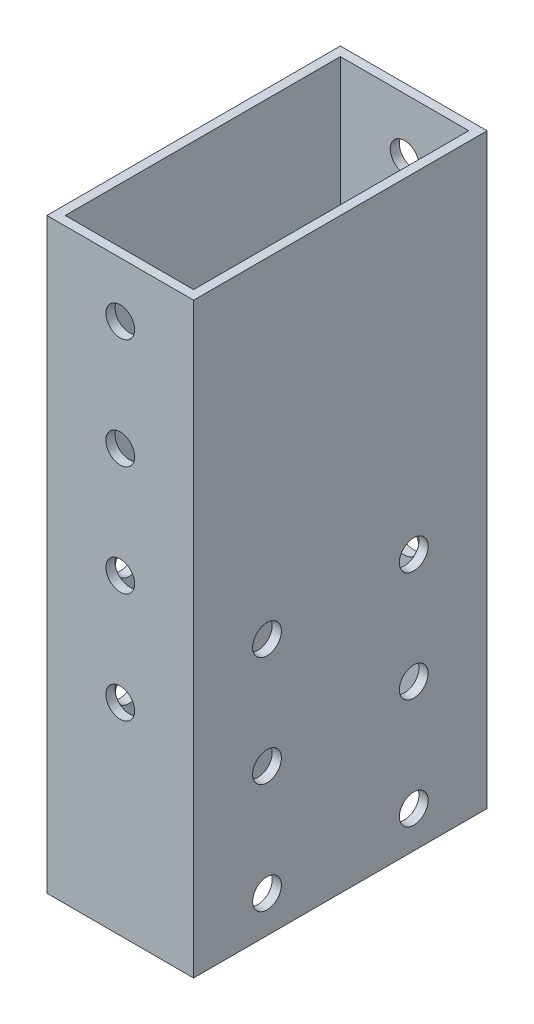
ISO-10303-21;
HEADER;
FILE_DESCRIPTION(('STEP AP214'),'2;1');
FILE_NAME('part.step','',(''),(''),'','','');
FILE_SCHEMA(('AUTOMOTIVE_DESIGN { 1 0 10303 214 1 1 1 1 }'));
ENDSEC;
DATA;
#1=APPLICATION_CONTEXT('core data for automotive mechanical design processes');
#2=APPLICATION_PROTOCOL_DEFINITION('international standard','automotive_design',2000,#1);
#3=PRODUCT_CONTEXT('',#1,'mechanical');
#4=PRODUCT('Part','Part','',(#3));
#5=PRODUCT_RELATED_PRODUCT_CATEGORY('part','',(#4));
#6=PRODUCT_DEFINITION_FORMATION('','',#4);
#7=PRODUCT_DEFINITION_CONTEXT('part definition',#1,'design');
#8=PRODUCT_DEFINITION('design','',#6,#7);
#9=PRODUCT_DEFINITION_SHAPE('','',#8);
#10=(LENGTH_UNIT() NAMED_UNIT(*) SI_UNIT(.MILLI.,.METRE.));
#11=(NAMED_UNIT(*) PLANE_ANGLE_UNIT() SI_UNIT($,.RADIAN.));
#12=(NAMED_UNIT(*) SI_UNIT($,.STERADIAN.) SOLID_ANGLE_UNIT());
#13=UNCERTAINTY_MEASURE_WITH_UNIT(LENGTH_MEASURE(1.E-05),#10,'distance_accuracy_value','');
#14=(GEOMETRIC_REPRESENTATION_CONTEXT(3) GLOBAL_UNCERTAINTY_ASSIGNED_CONTEXT((#13)) GLOBAL_UNIT_ASSIGNED_CONTEXT((#10,
#11,#12)) REPRESENTATION_CONTEXT('',''));
#15=CARTESIAN_POINT('',(0.,0.,0.));
#16=DIRECTION('',(0.,0.,1.));
#17=DIRECTION('',(1.,0.,0.));
#18=AXIS2_PLACEMENT_3D('',#15,#16,#17);
#19=CARTESIAN_POINT('',(0.,46.9771835147745,25.4));
#20=DIRECTION('',(0.,1.,0.));
#21=DIRECTION('',(0.,0.,1.));
#22=AXIS2_PLACEMENT_3D('',#19,#20,#21);
#23=PLANE('',#22);
#24=DIRECTION('',(1.,0.,0.));
#25=VECTOR('',#24,1.);
#26=CARTESIAN_POINT('',(0.,46.9771835147745,-25.4));
#27=LINE('',#26,#25);
#28=CARTESIAN_POINT('',(-116.088706292712,46.9771835147745,-25.4));
#29=VERTEX_POINT('',#28);
#30=CARTESIAN_POINT('',(-90.6887062927116,46.9771835147745,-25.4));
#31=VERTEX_POINT('',#30);
#32=EDGE_CURVE('E134',#29,#31,#27,.T.);
#33=ORIENTED_EDGE('',*,*,#32,.F.);
#34=DIRECTION('',(0.,0.,-1.));
#35=VECTOR('',#34,1.);
#36=CARTESIAN_POINT('',(-116.088706292712,46.9771835147745,25.4));
#37=LINE('',#36,#35);
#38=CARTESIAN_POINT('',(-116.088706292712,46.9771835147745,25.4));
#39=VERTEX_POINT('',#38);
#40=EDGE_CURVE('E11',#39,#29,#37,.T.);
#41=ORIENTED_EDGE('',*,*,#40,.F.);
#42=DIRECTION('',(1.,0.,0.));
#43=VECTOR('',#42,1.);
#44=CARTESIAN_POINT('',(0.,46.9771835147745,25.4));
#45=LINE('',#44,#43);
#46=CARTESIAN_POINT('',(-90.6887062927116,46.9771835147745,25.4));
#47=VERTEX_POINT('',#46);
#48=EDGE_CURVE('E139',#39,#47,#45,.T.);
#49=ORIENTED_EDGE('',*,*,#48,.T.);
#50=DIRECTION('',(0.,0.,-1.));
#51=VECTOR('',#50,1.);
#52=CARTESIAN_POINT('',(-90.6887062927116,46.9771835147745,25.4));
#53=LINE('',#52,#51);
#54=EDGE_CURVE('E151',#47,#31,#53,.T.);
#55=ORIENTED_EDGE('',*,*,#54,.T.);
#56=EDGE_LOOP('',(#33,#41,#49,#55));
#57=FACE_BOUND('',#56,.T.);
#58=DIRECTION('',(0.,0.,-1.));
#59=VECTOR('',#58,1.);
#60=CARTESIAN_POINT('',(-114.501206292712,46.9771835147745,25.4));
#61=LINE('',#60,#59);
#62=CARTESIAN_POINT('',(-114.501206292712,46.9771835147745,23.8125));
#63=VERTEX_POINT('',#62);
#64=CARTESIAN_POINT('',(-114.501206292712,46.9771835147745,-23.8125));
#65=VERTEX_POINT('',#64);
#66=EDGE_CURVE('E112',#63,#65,#61,.T.);
#67=ORIENTED_EDGE('',*,*,#66,.T.);
#68=DIRECTION('',(1.,0.,0.));
#69=VECTOR('',#68,1.);
#70=CARTESIAN_POINT('',(0.,46.9771835147745,-23.8125));
#71=LINE('',#70,#69);
#72=CARTESIAN_POINT('',(-92.2762062927116,46.9771835147745,-23.8125));
#73=VERTEX_POINT('',#72);
#74=EDGE_CURVE('E122',#65,#73,#71,.T.);
#75=ORIENTED_EDGE('',*,*,#74,.T.);
#76=DIRECTION('',(0.,0.,-1.));
#77=VECTOR('',#76,1.);
#78=CARTESIAN_POINT('',(-92.2762062927116,46.9771835147745,25.4));
#79=LINE('',#78,#77);
#80=CARTESIAN_POINT('',(-92.2762062927116,46.9771835147745,23.8125));
#81=VERTEX_POINT('',#80);
#82=EDGE_CURVE('E130',#81,#73,#79,.T.);
#83=ORIENTED_EDGE('',*,*,#82,.F.);
#84=DIRECTION('',(1.,0.,0.));
#85=VECTOR('',#84,1.);
#86=CARTESIAN_POINT('',(0.,46.9771835147745,23.8125));
#87=LINE('',#86,#85);
#88=EDGE_CURVE('E54',#63,#81,#87,.T.);
#89=ORIENTED_EDGE('',*,*,#88,.F.);
#90=EDGE_LOOP('',(#67,#75,#83,#89));
#91=FACE_BOUND('',#90,.T.);
#92=ADVANCED_FACE('F38',(#57,#91),#23,.T.);
#93=CARTESIAN_POINT('',(0.,-54.6228164852255,25.4));
#94=DIRECTION('',(0.,-1.,0.));
#95=DIRECTION('',(1.,0.,0.));
#96=AXIS2_PLACEMENT_3D('',#93,#94,#95);
#97=PLANE('',#96);
#98=DIRECTION('',(-1.,0.,0.));
#99=VECTOR('',#98,1.);
#100=CARTESIAN_POINT('',(0.,-54.6228164852255,-25.4));
#101=LINE('',#100,#99);
#102=CARTESIAN_POINT('',(-90.6887062927116,-54.6228164852255,-25.4));
#103=VERTEX_POINT('',#102);
#104=CARTESIAN_POINT('',(-116.088706292712,-54.6228164852255,-25.4));
#105=VERTEX_POINT('',#104);
#106=EDGE_CURVE('E157',#103,#105,#101,.T.);
#107=ORIENTED_EDGE('',*,*,#106,.F.);
#108=DIRECTION('',(0.,0.,-1.));
#109=VECTOR('',#108,1.);
#110=CARTESIAN_POINT('',(-90.6887062927116,-54.6228164852255,25.4));
#111=LINE('',#110,#109);
#112=CARTESIAN_POINT('',(-90.6887062927116,-54.6228164852255,25.4));
#113=VERTEX_POINT('',#112);
#114=EDGE_CURVE('E163',#113,#103,#111,.T.);
#115=ORIENTED_EDGE('',*,*,#114,.F.);
#116=DIRECTION('',(-1.,0.,0.));
#117=VECTOR('',#116,1.);
#118=CARTESIAN_POINT('',(0.,-54.6228164852255,25.4));
#119=LINE('',#118,#117);
#120=CARTESIAN_POINT('',(-116.088706292712,-54.6228164852255,25.4));
#121=VERTEX_POINT('',#120);
#122=EDGE_CURVE('E146',#113,#121,#119,.T.);
#123=ORIENTED_EDGE('',*,*,#122,.T.);
#124=DIRECTION('',(0.,0.,-1.));
#125=VECTOR('',#124,1.);
#126=CARTESIAN_POINT('',(-116.088706292712,-54.6228164852255,25.4));
#127=LINE('',#126,#125);
#128=EDGE_CURVE('E46',#121,#105,#127,.T.);
#129=ORIENTED_EDGE('',*,*,#128,.T.);
#130=EDGE_LOOP('',(#107,#115,#123,#129));
#131=FACE_BOUND('',#130,.T.);
#132=DIRECTION('',(0.,0.,-1.));
#133=VECTOR('',#132,1.);
#134=CARTESIAN_POINT('',(-92.2762062927116,-54.6228164852255,25.4));
#135=LINE('',#134,#133);
#136=CARTESIAN_POINT('',(-92.2762062927116,-54.6228164852255,23.8125));
#137=VERTEX_POINT('',#136);
#138=CARTESIAN_POINT('',(-92.2762062927116,-54.6228164852255,-23.8125));
#139=VERTEX_POINT('',#138);
#140=EDGE_CURVE('E113',#137,#139,#135,.T.);
#141=ORIENTED_EDGE('',*,*,#140,.T.);
#142=DIRECTION('',(-1.,0.,0.));
#143=VECTOR('',#142,1.);
#144=CARTESIAN_POINT('',(0.,-54.6228164852255,-23.8125));
#145=LINE('',#144,#143);
#146=CARTESIAN_POINT('',(-114.501206292712,-54.6228164852255,-23.8125));
#147=VERTEX_POINT('',#146);
#148=EDGE_CURVE('E119',#139,#147,#145,.T.);
#149=ORIENTED_EDGE('',*,*,#148,.T.);
#150=DIRECTION('',(0.,0.,-1.));
#151=VECTOR('',#150,1.);
#152=CARTESIAN_POINT('',(-114.501206292712,-54.6228164852255,25.4));
#153=LINE('',#152,#151);
#154=CARTESIAN_POINT('',(-114.501206292712,-54.6228164852255,23.8125));
#155=VERTEX_POINT('',#154);
#156=EDGE_CURVE('E104',#155,#147,#153,.T.);
#157=ORIENTED_EDGE('',*,*,#156,.F.);
#158=DIRECTION('',(-1.,0.,0.));
#159=VECTOR('',#158,1.);
#160=CARTESIAN_POINT('',(0.,-54.6228164852255,23.8125));
#161=LINE('',#160,#159);
#162=EDGE_CURVE('E59',#137,#155,#161,.T.);
#163=ORIENTED_EDGE('',*,*,#162,.F.);
#164=EDGE_LOOP('',(#141,#149,#157,#163));
#165=FACE_BOUND('',#164,.T.);
#166=ADVANCED_FACE('F124',(#131,#165),#97,.T.);
#167=CARTESIAN_POINT('',(-116.088706292712,0.,25.4));
#168=DIRECTION('',(-1.,0.,0.));
#169=DIRECTION('',(0.,-1.,0.));
#170=AXIS2_PLACEMENT_3D('',#167,#168,#169);
#171=PLANE('',#170);
#172=CARTESIAN_POINT('',(-116.088706292712,-48.2728164852255,12.7));
#173=DIRECTION('',(-1.,0.,0.));
#174=DIRECTION('',(0.,0.,1.));
#175=AXIS2_PLACEMENT_3D('',#172,#173,#174);
#176=CIRCLE('',#175,2.4892);
#177=CARTESIAN_POINT('',(-116.088706292712,-48.2728164852255,15.1892));
#178=VERTEX_POINT('',#177);
#179=EDGE_CURVE('E190',#178,#178,#176,.T.);
#180=ORIENTED_EDGE('',*,*,#179,.F.);
#181=EDGE_LOOP('',(#180));
#182=FACE_BOUND('',#181,.T.);
#183=CARTESIAN_POINT('',(-116.088706292712,-48.2728164852255,-12.7));
#184=DIRECTION('',(-1.,0.,0.));
#185=DIRECTION('',(0.,0.,1.));
#186=AXIS2_PLACEMENT_3D('',#183,#184,#185);
#187=CIRCLE('',#186,2.4892);
#188=CARTESIAN_POINT('',(-116.088706292712,-48.2728164852255,-10.2108));
#189=VERTEX_POINT('',#188);
#190=EDGE_CURVE('E636',#189,#189,#187,.T.);
#191=ORIENTED_EDGE('',*,*,#190,.F.);
#192=EDGE_LOOP('',(#191));
#193=FACE_BOUND('',#192,.T.);
#194=CARTESIAN_POINT('',(-116.088706292712,-29.2228164852255,12.7));
#195=DIRECTION('',(-1.,0.,0.));
#196=DIRECTION('',(0.,0.,1.));
#197=AXIS2_PLACEMENT_3D('',#194,#195,#196);
#198=CIRCLE('',#197,2.4892);
#199=CARTESIAN_POINT('',(-116.088706292712,-29.2228164852255,15.1892));
#200=VERTEX_POINT('',#199);
#201=EDGE_CURVE('E633',#200,#200,#198,.T.);
#202=ORIENTED_EDGE('',*,*,#201,.F.);
#203=EDGE_LOOP('',(#202));
#204=FACE_BOUND('',#203,.T.);
#205=CARTESIAN_POINT('',(-116.088706292712,-29.2228164852255,-12.7));
#206=DIRECTION('',(-1.,0.,0.));
#207=DIRECTION('',(0.,0.,1.));
#208=AXIS2_PLACEMENT_3D('',#205,#206,#207);
#209=CIRCLE('',#208,2.48920000000003);
#210=CARTESIAN_POINT('',(-116.088706292712,-29.2228164852255,-10.2108));
#211=VERTEX_POINT('',#210);
#212=EDGE_CURVE('E630',#211,#211,#209,.T.);
#213=ORIENTED_EDGE('',*,*,#212,.F.);
#214=EDGE_LOOP('',(#213));
#215=FACE_BOUND('',#214,.T.);
#216=CARTESIAN_POINT('',(-116.088706292712,-10.1728164852255,12.7));
#217=DIRECTION('',(-1.,0.,0.));
#218=DIRECTION('',(0.,0.,1.));
#219=AXIS2_PLACEMENT_3D('',#216,#217,#218);
#220=CIRCLE('',#219,2.4892);
#221=CARTESIAN_POINT('',(-116.088706292712,-10.1728164852255,15.1892));
#222=VERTEX_POINT('',#221);
#223=EDGE_CURVE('E627',#222,#222,#220,.T.);
#224=ORIENTED_EDGE('',*,*,#223,.F.);
#225=EDGE_LOOP('',(#224));
#226=FACE_BOUND('',#225,.T.);
#227=CARTESIAN_POINT('',(-116.088706292712,-10.1728164852255,-12.7));
#228=DIRECTION('',(-1.,0.,0.));
#229=DIRECTION('',(0.,0.,1.));
#230=AXIS2_PLACEMENT_3D('',#227,#228,#229);
#231=CIRCLE('',#230,2.48920000000003);
#232=CARTESIAN_POINT('',(-116.088706292712,-10.1728164852255,-10.2108));
#233=VERTEX_POINT('',#232);
#234=EDGE_CURVE('E610',#233,#233,#231,.T.);
#235=ORIENTED_EDGE('',*,*,#234,.F.);
#236=EDGE_LOOP('',(#235));
#237=FACE_BOUND('',#236,.T.);
#238=DIRECTION('',(0.,1.,0.));
#239=VECTOR('',#238,1.);
#240=CARTESIAN_POINT('',(-116.088706292712,0.,-25.4));
#241=LINE('',#240,#239);
#242=EDGE_CURVE('E154',#105,#29,#241,.T.);
#243=ORIENTED_EDGE('',*,*,#242,.F.);
#244=ORIENTED_EDGE('',*,*,#128,.F.);
#245=DIRECTION('',(0.,1.,0.));
#246=VECTOR('',#245,1.);
#247=CARTESIAN_POINT('',(-116.088706292712,0.,25.4));
#248=LINE('',#247,#246);
#249=EDGE_CURVE('E142',#121,#39,#248,.T.);
#250=ORIENTED_EDGE('',*,*,#249,.T.);
#251=ORIENTED_EDGE('',*,*,#40,.T.);
#252=EDGE_LOOP('',(#243,#244,#250,#251));
#253=FACE_BOUND('',#252,.T.);
#254=ADVANCED_FACE('F281',(#182,#193,#204,#215,#226,#237,#253),#171,.T.);
#255=CARTESIAN_POINT('',(-90.6887062927116,0.,25.4));
#256=DIRECTION('',(-1.,0.,0.));
#257=DIRECTION('',(0.,0.,1.));
#258=AXIS2_PLACEMENT_3D('',#255,#256,#257);
#259=PLANE('',#258);
#260=CARTESIAN_POINT('',(-90.6887062927116,-48.2728164852255,12.7));
#261=DIRECTION('',(-1.,0.,0.));
#262=DIRECTION('',(0.,0.,1.));
#263=AXIS2_PLACEMENT_3D('',#260,#261,#262);
#264=CIRCLE('',#263,2.4892);
#265=CARTESIAN_POINT('',(-90.6887062927116,-48.2728164852255,15.1892));
#266=VERTEX_POINT('',#265);
#267=EDGE_CURVE('E227',#266,#266,#264,.T.);
#268=ORIENTED_EDGE('',*,*,#267,.T.);
#269=EDGE_LOOP('',(#268));
#270=FACE_BOUND('',#269,.T.);
#271=CARTESIAN_POINT('',(-90.6887062927116,-48.2728164852255,-12.7));
#272=DIRECTION('',(-1.,0.,0.));
#273=DIRECTION('',(0.,0.,1.));
#274=AXIS2_PLACEMENT_3D('',#271,#272,#273);
#275=CIRCLE('',#274,2.4892);
#276=CARTESIAN_POINT('',(-90.6887062927116,-48.2728164852255,-10.2108));
#277=VERTEX_POINT('',#276);
#278=EDGE_CURVE('E212',#277,#277,#275,.T.);
#279=ORIENTED_EDGE('',*,*,#278,.T.);
#280=EDGE_LOOP('',(#279));
#281=FACE_BOUND('',#280,.T.);
#282=CARTESIAN_POINT('',(-90.6887062927116,-29.2228164852255,12.7));
#283=DIRECTION('',(-1.,0.,0.));
#284=DIRECTION('',(0.,0.,1.));
#285=AXIS2_PLACEMENT_3D('',#282,#283,#284);
#286=CIRCLE('',#285,2.4892);
#287=CARTESIAN_POINT('',(-90.6887062927116,-29.2228164852255,15.1892));
#288=VERTEX_POINT('',#287);
#289=EDGE_CURVE('E208',#288,#288,#286,.T.);
#290=ORIENTED_EDGE('',*,*,#289,.T.);
#291=EDGE_LOOP('',(#290));
#292=FACE_BOUND('',#291,.T.);
#293=CARTESIAN_POINT('',(-90.6887062927116,-29.2228164852255,-12.7));
#294=DIRECTION('',(-1.,0.,0.));
#295=DIRECTION('',(0.,0.,1.));
#296=AXIS2_PLACEMENT_3D('',#293,#294,#295);
#297=CIRCLE('',#296,2.48920000000003);
#298=CARTESIAN_POINT('',(-90.6887062927116,-29.2228164852255,-10.2108));
#299=VERTEX_POINT('',#298);
#300=EDGE_CURVE('E204',#299,#299,#297,.T.);
#301=ORIENTED_EDGE('',*,*,#300,.T.);
#302=EDGE_LOOP('',(#301));
#303=FACE_BOUND('',#302,.T.);
#304=CARTESIAN_POINT('',(-90.6887062927116,-10.1728164852255,12.7));
#305=DIRECTION('',(-1.,0.,0.));
#306=DIRECTION('',(0.,0.,1.));
#307=AXIS2_PLACEMENT_3D('',#304,#305,#306);
#308=CIRCLE('',#307,2.4892);
#309=CARTESIAN_POINT('',(-90.6887062927116,-10.1728164852255,15.1892));
#310=VERTEX_POINT('',#309);
#311=EDGE_CURVE('E200',#310,#310,#308,.T.);
#312=ORIENTED_EDGE('',*,*,#311,.T.);
#313=EDGE_LOOP('',(#312));
#314=FACE_BOUND('',#313,.T.);
#315=CARTESIAN_POINT('',(-90.6887062927116,-10.1728164852255,-12.7));
#316=DIRECTION('',(-1.,0.,0.));
#317=DIRECTION('',(0.,0.,1.));
#318=AXIS2_PLACEMENT_3D('',#315,#316,#317);
#319=CIRCLE('',#318,2.48920000000003);
#320=CARTESIAN_POINT('',(-90.6887062927116,-10.1728164852255,-10.2108));
#321=VERTEX_POINT('',#320);
#322=EDGE_CURVE('E195',#321,#321,#319,.T.);
#323=ORIENTED_EDGE('',*,*,#322,.T.);
#324=EDGE_LOOP('',(#323));
#325=FACE_BOUND('',#324,.T.);
#326=DIRECTION('',(0.,1.,0.));
#327=VECTOR('',#326,1.);
#328=CARTESIAN_POINT('',(-90.6887062927116,0.,-25.4));
#329=LINE('',#328,#327);
#330=EDGE_CURVE('E143',#103,#31,#329,.T.);
#331=ORIENTED_EDGE('',*,*,#330,.T.);
#332=ORIENTED_EDGE('',*,*,#54,.F.);
#333=DIRECTION('',(0.,1.,0.));
#334=VECTOR('',#333,1.);
#335=CARTESIAN_POINT('',(-90.6887062927116,0.,25.4));
#336=LINE('',#335,#334);
#337=EDGE_CURVE('E149',#113,#47,#336,.T.);
#338=ORIENTED_EDGE('',*,*,#337,.F.);
#339=ORIENTED_EDGE('',*,*,#114,.T.);
#340=EDGE_LOOP('',(#331,#332,#338,#339));
#341=FACE_BOUND('',#340,.T.);
#342=ADVANCED_FACE('F299',(#270,#281,#292,#303,#314,#325,#341),#259,.F.);
#343=CARTESIAN_POINT('',(0.,0.,25.4));
#344=DIRECTION('',(0.,0.,1.));
#345=DIRECTION('',(1.,0.,0.));
#346=AXIS2_PLACEMENT_3D('',#343,#344,#345);
#347=PLANE('',#346);
#348=CARTESIAN_POINT('',(-103.388706292712,18.4021835147745,25.4));
#349=DIRECTION('',(0.,0.,1.));
#350=DIRECTION('',(1.,0.,0.));
#351=AXIS2_PLACEMENT_3D('',#348,#349,#350);
#352=CIRCLE('',#351,2.48920000000015);
#353=CARTESIAN_POINT('',(-100.899506292711,18.4021835147745,25.4));
#354=VERTEX_POINT('',#353);
#355=EDGE_CURVE('E170',#354,#354,#352,.T.);
#356=ORIENTED_EDGE('',*,*,#355,.F.);
#357=EDGE_LOOP('',(#356));
#358=FACE_BOUND('',#357,.T.);
#359=CARTESIAN_POINT('',(-103.388706292712,-19.6978164852255,25.4));
#360=DIRECTION('',(0.,0.,1.));
#361=DIRECTION('',(1.,0.,0.));
#362=AXIS2_PLACEMENT_3D('',#359,#360,#361);
#363=CIRCLE('',#362,2.48920000000003);
#364=CARTESIAN_POINT('',(-100.899506292712,-19.6978164852255,25.4));
#365=VERTEX_POINT('',#364);
#366=EDGE_CURVE('E233',#365,#365,#363,.T.);
#367=ORIENTED_EDGE('',*,*,#366,.F.);
#368=EDGE_LOOP('',(#367));
#369=FACE_BOUND('',#368,.T.);
#370=CARTESIAN_POINT('',(-103.388706292712,-0.647816485225543,25.4));
#371=DIRECTION('',(0.,0.,1.));
#372=DIRECTION('',(1.,0.,0.));
#373=AXIS2_PLACEMENT_3D('',#370,#371,#372);
#374=CIRCLE('',#373,2.4892);
#375=CARTESIAN_POINT('',(-100.899506292712,-0.647816485225543,25.4));
#376=VERTEX_POINT('',#375);
#377=EDGE_CURVE('E236',#376,#376,#374,.T.);
#378=ORIENTED_EDGE('',*,*,#377,.F.);
#379=EDGE_LOOP('',(#378));
#380=FACE_BOUND('',#379,.T.);
#381=CARTESIAN_POINT('',(-103.388706292712,37.4521835147745,25.4));
#382=DIRECTION('',(0.,0.,1.));
#383=DIRECTION('',(1.,0.,0.));
#384=AXIS2_PLACEMENT_3D('',#381,#382,#383);
#385=CIRCLE('',#384,2.4892);
#386=CARTESIAN_POINT('',(-100.899506292712,37.4521835147745,25.4));
#387=VERTEX_POINT('',#386);
#388=EDGE_CURVE('E230',#387,#387,#385,.T.);
#389=ORIENTED_EDGE('',*,*,#388,.F.);
#390=EDGE_LOOP('',(#389));
#391=FACE_BOUND('',#390,.T.);
#392=ORIENTED_EDGE('',*,*,#48,.F.);
#393=ORIENTED_EDGE('',*,*,#249,.F.);
#394=ORIENTED_EDGE('',*,*,#122,.F.);
#395=ORIENTED_EDGE('',*,*,#337,.T.);
#396=EDGE_LOOP('',(#392,#393,#394,#395));
#397=FACE_BOUND('',#396,.T.);
#398=ADVANCED_FACE('F296',(#358,#369,#380,#391,#397),#347,.T.);
#399=CARTESIAN_POINT('',(0.,0.,-25.4));
#400=DIRECTION('',(0.,0.,1.));
#401=DIRECTION('',(1.,0.,0.));
#402=AXIS2_PLACEMENT_3D('',#399,#400,#401);
#403=PLANE('',#402);
#404=CARTESIAN_POINT('',(-103.388706292712,18.4021835147745,-25.4));
#405=DIRECTION('',(0.,0.,1.));
#406=DIRECTION('',(1.,0.,0.));
#407=AXIS2_PLACEMENT_3D('',#404,#405,#406);
#408=CIRCLE('',#407,2.48920000000015);
#409=CARTESIAN_POINT('',(-100.899506292711,18.4021835147745,-25.4));
#410=VERTEX_POINT('',#409);
#411=EDGE_CURVE('E138',#410,#410,#408,.T.);
#412=ORIENTED_EDGE('',*,*,#411,.T.);
#413=EDGE_LOOP('',(#412));
#414=FACE_BOUND('',#413,.T.);
#415=CARTESIAN_POINT('',(-103.388706292712,-19.6978164852255,-25.4));
#416=DIRECTION('',(0.,0.,1.));
#417=DIRECTION('',(1.,0.,0.));
#418=AXIS2_PLACEMENT_3D('',#415,#416,#417);
#419=CIRCLE('',#418,2.48920000000003);
#420=CARTESIAN_POINT('',(-100.899506292712,-19.6978164852255,-25.4));
#421=VERTEX_POINT('',#420);
#422=EDGE_CURVE('E185',#421,#421,#419,.T.);
#423=ORIENTED_EDGE('',*,*,#422,.T.);
#424=EDGE_LOOP('',(#423));
#425=FACE_BOUND('',#424,.T.);
#426=CARTESIAN_POINT('',(-103.388706292712,-0.647816485225543,-25.4));
#427=DIRECTION('',(0.,0.,1.));
#428=DIRECTION('',(1.,0.,0.));
#429=AXIS2_PLACEMENT_3D('',#426,#427,#428);
#430=CIRCLE('',#429,2.4892);
#431=CARTESIAN_POINT('',(-100.899506292712,-0.647816485225543,-25.4));
#432=VERTEX_POINT('',#431);
#433=EDGE_CURVE('E180',#432,#432,#430,.T.);
#434=ORIENTED_EDGE('',*,*,#433,.T.);
#435=EDGE_LOOP('',(#434));
#436=FACE_BOUND('',#435,.T.);
#437=CARTESIAN_POINT('',(-103.388706292712,37.4521835147745,-25.4));
#438=DIRECTION('',(0.,0.,1.));
#439=DIRECTION('',(1.,0.,0.));
#440=AXIS2_PLACEMENT_3D('',#437,#438,#439);
#441=CIRCLE('',#440,2.4892);
#442=CARTESIAN_POINT('',(-100.899506292712,37.4521835147745,-25.4));
#443=VERTEX_POINT('',#442);
#444=EDGE_CURVE('E175',#443,#443,#441,.T.);
#445=ORIENTED_EDGE('',*,*,#444,.T.);
#446=EDGE_LOOP('',(#445));
#447=FACE_BOUND('',#446,.T.);
#448=ORIENTED_EDGE('',*,*,#32,.T.);
#449=ORIENTED_EDGE('',*,*,#330,.F.);
#450=ORIENTED_EDGE('',*,*,#106,.T.);
#451=ORIENTED_EDGE('',*,*,#242,.T.);
#452=EDGE_LOOP('',(#448,#449,#450,#451));
#453=FACE_BOUND('',#452,.T.);
#454=ADVANCED_FACE('F290',(#414,#425,#436,#447,#453),#403,.F.);
#455=CARTESIAN_POINT('',(-114.501206292712,0.,25.4));
#456=DIRECTION('',(-1.,0.,0.));
#457=DIRECTION('',(0.,-1.,0.));
#458=AXIS2_PLACEMENT_3D('',#455,#456,#457);
#459=PLANE('',#458);
#460=CARTESIAN_POINT('',(-114.501206292712,-48.2728164852255,12.7));
#461=DIRECTION('',(-1.,0.,0.));
#462=DIRECTION('',(0.,-1.,0.));
#463=AXIS2_PLACEMENT_3D('',#460,#461,#462);
#464=CIRCLE('',#463,2.4892);
#465=CARTESIAN_POINT('',(-114.501206292712,-50.7620164852255,12.7));
#466=VERTEX_POINT('',#465);
#467=EDGE_CURVE('E224',#466,#466,#464,.T.);
#468=ORIENTED_EDGE('',*,*,#467,.T.);
#469=EDGE_LOOP('',(#468));
#470=FACE_BOUND('',#469,.T.);
#471=CARTESIAN_POINT('',(-114.501206292712,-48.2728164852255,-12.7));
#472=DIRECTION('',(-1.,0.,0.));
#473=DIRECTION('',(0.,-1.,0.));
#474=AXIS2_PLACEMENT_3D('',#471,#472,#473);
#475=CIRCLE('',#474,2.4892);
#476=CARTESIAN_POINT('',(-114.501206292712,-50.7620164852255,-12.7));
#477=VERTEX_POINT('',#476);
#478=EDGE_CURVE('E207',#477,#477,#475,.T.);
#479=ORIENTED_EDGE('',*,*,#478,.T.);
#480=EDGE_LOOP('',(#479));
#481=FACE_BOUND('',#480,.T.);
#482=CARTESIAN_POINT('',(-114.501206292712,-29.2228164852255,12.7));
#483=DIRECTION('',(-1.,0.,0.));
#484=DIRECTION('',(0.,-1.,0.));
#485=AXIS2_PLACEMENT_3D('',#482,#483,#484);
#486=CIRCLE('',#485,2.4892);
#487=CARTESIAN_POINT('',(-114.501206292712,-31.7120164852255,12.7));
#488=VERTEX_POINT('',#487);
#489=EDGE_CURVE('E203',#488,#488,#486,.T.);
#490=ORIENTED_EDGE('',*,*,#489,.T.);
#491=EDGE_LOOP('',(#490));
#492=FACE_BOUND('',#491,.T.);
#493=CARTESIAN_POINT('',(-114.501206292712,-29.2228164852255,-12.7));
#494=DIRECTION('',(-1.,0.,0.));
#495=DIRECTION('',(0.,-1.,0.));
#496=AXIS2_PLACEMENT_3D('',#493,#494,#495);
#497=CIRCLE('',#496,2.48920000000003);
#498=CARTESIAN_POINT('',(-114.501206292712,-31.7120164852256,-12.7));
#499=VERTEX_POINT('',#498);
#500=EDGE_CURVE('E199',#499,#499,#497,.T.);
#501=ORIENTED_EDGE('',*,*,#500,.T.);
#502=EDGE_LOOP('',(#501));
#503=FACE_BOUND('',#502,.T.);
#504=CARTESIAN_POINT('',(-114.501206292712,-10.1728164852255,12.7));
#505=DIRECTION('',(-1.,0.,0.));
#506=DIRECTION('',(0.,-1.,0.));
#507=AXIS2_PLACEMENT_3D('',#504,#505,#506);
#508=CIRCLE('',#507,2.4892);
#509=CARTESIAN_POINT('',(-114.501206292712,-12.6620164852255,12.7));
#510=VERTEX_POINT('',#509);
#511=EDGE_CURVE('E194',#510,#510,#508,.T.);
#512=ORIENTED_EDGE('',*,*,#511,.T.);
#513=EDGE_LOOP('',(#512));
#514=FACE_BOUND('',#513,.T.);
#515=CARTESIAN_POINT('',(-114.501206292712,-10.1728164852255,-12.7));
#516=DIRECTION('',(-1.,0.,0.));
#517=DIRECTION('',(0.,-1.,0.));
#518=AXIS2_PLACEMENT_3D('',#515,#516,#517);
#519=CIRCLE('',#518,2.48920000000003);
#520=CARTESIAN_POINT('',(-114.501206292712,-12.6620164852256,-12.7));
#521=VERTEX_POINT('',#520);
#522=EDGE_CURVE('E189',#521,#521,#519,.T.);
#523=ORIENTED_EDGE('',*,*,#522,.T.);
#524=EDGE_LOOP('',(#523));
#525=FACE_BOUND('',#524,.T.);
#526=DIRECTION('',(0.,1.,0.));
#527=VECTOR('',#526,1.);
#528=CARTESIAN_POINT('',(-114.501206292712,0.,-23.8125));
#529=LINE('',#528,#527);
#530=EDGE_CURVE('E107',#147,#65,#529,.T.);
#531=ORIENTED_EDGE('',*,*,#530,.T.);
#532=ORIENTED_EDGE('',*,*,#66,.F.);
#533=DIRECTION('',(0.,1.,0.));
#534=VECTOR('',#533,1.);
#535=CARTESIAN_POINT('',(-114.501206292712,0.,23.8125));
#536=LINE('',#535,#534);
#537=EDGE_CURVE('E109',#155,#63,#536,.T.);
#538=ORIENTED_EDGE('',*,*,#537,.F.);
#539=ORIENTED_EDGE('',*,*,#156,.T.);
#540=EDGE_LOOP('',(#531,#532,#538,#539));
#541=FACE_BOUND('',#540,.T.);
#542=ADVANCED_FACE('F106',(#470,#481,#492,#503,#514,#525,#541),#459,.F.);
#543=CARTESIAN_POINT('',(-92.2762062927116,0.,25.4));
#544=DIRECTION('',(-1.,0.,0.));
#545=DIRECTION('',(0.,0.,1.));
#546=AXIS2_PLACEMENT_3D('',#543,#544,#545);
#547=PLANE('',#546);
#548=CARTESIAN_POINT('',(-92.2762062927116,-48.2728164852255,12.7));
#549=DIRECTION('',(-1.,0.,0.));
#550=DIRECTION('',(0.,0.,1.));
#551=AXIS2_PLACEMENT_3D('',#548,#549,#550);
#552=CIRCLE('',#551,2.4892);
#553=CARTESIAN_POINT('',(-92.2762062927116,-48.2728164852255,15.1892));
#554=VERTEX_POINT('',#553);
#555=EDGE_CURVE('E41',#554,#554,#552,.T.);
#556=ORIENTED_EDGE('',*,*,#555,.F.);
#557=EDGE_LOOP('',(#556));
#558=FACE_BOUND('',#557,.T.);
#559=CARTESIAN_POINT('',(-92.2762062927116,-48.2728164852255,-12.7));
#560=DIRECTION('',(-1.,0.,0.));
#561=DIRECTION('',(0.,0.,1.));
#562=AXIS2_PLACEMENT_3D('',#559,#560,#561);
#563=CIRCLE('',#562,2.4892);
#564=CARTESIAN_POINT('',(-92.2762062927116,-48.2728164852255,-10.2108));
#565=VERTEX_POINT('',#564);
#566=EDGE_CURVE('E205',#565,#565,#563,.T.);
#567=ORIENTED_EDGE('',*,*,#566,.F.);
#568=EDGE_LOOP('',(#567));
#569=FACE_BOUND('',#568,.T.);
#570=CARTESIAN_POINT('',(-92.2762062927116,-29.2228164852255,12.7));
#571=DIRECTION('',(-1.,0.,0.));
#572=DIRECTION('',(0.,0.,1.));
#573=AXIS2_PLACEMENT_3D('',#570,#571,#572);
#574=CIRCLE('',#573,2.4892);
#575=CARTESIAN_POINT('',(-92.2762062927116,-29.2228164852255,15.1892));
#576=VERTEX_POINT('',#575);
#577=EDGE_CURVE('E201',#576,#576,#574,.T.);
#578=ORIENTED_EDGE('',*,*,#577,.F.);
#579=EDGE_LOOP('',(#578));
#580=FACE_BOUND('',#579,.T.);
#581=CARTESIAN_POINT('',(-92.2762062927116,-29.2228164852255,-12.7));
#582=DIRECTION('',(-1.,0.,0.));
#583=DIRECTION('',(0.,0.,1.));
#584=AXIS2_PLACEMENT_3D('',#581,#582,#583);
#585=CIRCLE('',#584,2.48920000000003);
#586=CARTESIAN_POINT('',(-92.2762062927116,-29.2228164852255,-10.2108));
#587=VERTEX_POINT('',#586);
#588=EDGE_CURVE('E196',#587,#587,#585,.T.);
#589=ORIENTED_EDGE('',*,*,#588,.F.);
#590=EDGE_LOOP('',(#589));
#591=FACE_BOUND('',#590,.T.);
#592=CARTESIAN_POINT('',(-92.2762062927116,-10.1728164852255,12.7));
#593=DIRECTION('',(-1.,0.,0.));
#594=DIRECTION('',(0.,0.,1.));
#595=AXIS2_PLACEMENT_3D('',#592,#593,#594);
#596=CIRCLE('',#595,2.4892);
#597=CARTESIAN_POINT('',(-92.2762062927116,-10.1728164852255,15.1892));
#598=VERTEX_POINT('',#597);
#599=EDGE_CURVE('E191',#598,#598,#596,.T.);
#600=ORIENTED_EDGE('',*,*,#599,.F.);
#601=EDGE_LOOP('',(#600));
#602=FACE_BOUND('',#601,.T.);
#603=CARTESIAN_POINT('',(-92.2762062927116,-10.1728164852255,-12.7));
#604=DIRECTION('',(-1.,0.,0.));
#605=DIRECTION('',(0.,0.,1.));
#606=AXIS2_PLACEMENT_3D('',#603,#604,#605);
#607=CIRCLE('',#606,2.48920000000003);
#608=CARTESIAN_POINT('',(-92.2762062927116,-10.1728164852255,-10.2108));
#609=VERTEX_POINT('',#608);
#610=EDGE_CURVE('E186',#609,#609,#607,.T.);
#611=ORIENTED_EDGE('',*,*,#610,.F.);
#612=EDGE_LOOP('',(#611));
#613=FACE_BOUND('',#612,.T.);
#614=DIRECTION('',(0.,1.,0.));
#615=VECTOR('',#614,1.);
#616=CARTESIAN_POINT('',(-92.2762062927116,0.,-23.8125));
#617=LINE('',#616,#615);
#618=EDGE_CURVE('E125',#139,#73,#617,.T.);
#619=ORIENTED_EDGE('',*,*,#618,.F.);
#620=ORIENTED_EDGE('',*,*,#140,.F.);
#621=DIRECTION('',(0.,1.,0.));
#622=VECTOR('',#621,1.);
#623=CARTESIAN_POINT('',(-92.2762062927116,0.,23.8125));
#624=LINE('',#623,#622);
#625=EDGE_CURVE('E132',#137,#81,#624,.T.);
#626=ORIENTED_EDGE('',*,*,#625,.T.);
#627=ORIENTED_EDGE('',*,*,#82,.T.);
#628=EDGE_LOOP('',(#619,#620,#626,#627));
#629=FACE_BOUND('',#628,.T.);
#630=ADVANCED_FACE('F260',(#558,#569,#580,#591,#602,#613,#629),#547,.T.);
#631=CARTESIAN_POINT('',(0.,0.,23.8125));
#632=DIRECTION('',(0.,0.,1.));
#633=DIRECTION('',(1.,0.,0.));
#634=AXIS2_PLACEMENT_3D('',#631,#632,#633);
#635=PLANE('',#634);
#636=CARTESIAN_POINT('',(-103.388706292712,18.4021835147745,23.8125));
#637=DIRECTION('',(0.,0.,1.));
#638=DIRECTION('',(1.,0.,0.));
#639=AXIS2_PLACEMENT_3D('',#636,#637,#638);
#640=CIRCLE('',#639,2.48920000000015);
#641=CARTESIAN_POINT('',(-100.899506292711,18.4021835147745,23.8125));
#642=VERTEX_POINT('',#641);
#643=EDGE_CURVE('E184',#642,#642,#640,.T.);
#644=ORIENTED_EDGE('',*,*,#643,.T.);
#645=EDGE_LOOP('',(#644));
#646=FACE_BOUND('',#645,.T.);
#647=CARTESIAN_POINT('',(-103.388706292712,-19.6978164852255,23.8125));
#648=DIRECTION('',(0.,0.,1.));
#649=DIRECTION('',(1.,0.,0.));
#650=AXIS2_PLACEMENT_3D('',#647,#648,#649);
#651=CIRCLE('',#650,2.48920000000003);
#652=CARTESIAN_POINT('',(-100.899506292712,-19.6978164852255,23.8125));
#653=VERTEX_POINT('',#652);
#654=EDGE_CURVE('E179',#653,#653,#651,.T.);
#655=ORIENTED_EDGE('',*,*,#654,.T.);
#656=EDGE_LOOP('',(#655));
#657=FACE_BOUND('',#656,.T.);
#658=CARTESIAN_POINT('',(-103.388706292712,-0.647816485225543,23.8125));
#659=DIRECTION('',(0.,0.,1.));
#660=DIRECTION('',(1.,0.,0.));
#661=AXIS2_PLACEMENT_3D('',#658,#659,#660);
#662=CIRCLE('',#661,2.4892);
#663=CARTESIAN_POINT('',(-100.899506292712,-0.647816485225543,23.8125));
#664=VERTEX_POINT('',#663);
#665=EDGE_CURVE('E174',#664,#664,#662,.T.);
#666=ORIENTED_EDGE('',*,*,#665,.T.);
#667=EDGE_LOOP('',(#666));
#668=FACE_BOUND('',#667,.T.);
#669=CARTESIAN_POINT('',(-103.388706292712,37.4521835147745,23.8125));
#670=DIRECTION('',(0.,0.,1.));
#671=DIRECTION('',(1.,0.,0.));
#672=AXIS2_PLACEMENT_3D('',#669,#670,#671);
#673=CIRCLE('',#672,2.4892);
#674=CARTESIAN_POINT('',(-100.899506292712,37.4521835147745,23.8125));
#675=VERTEX_POINT('',#674);
#676=EDGE_CURVE('E169',#675,#675,#673,.T.);
#677=ORIENTED_EDGE('',*,*,#676,.T.);
#678=EDGE_LOOP('',(#677));
#679=FACE_BOUND('',#678,.T.);
#680=ORIENTED_EDGE('',*,*,#88,.T.);
#681=ORIENTED_EDGE('',*,*,#625,.F.);
#682=ORIENTED_EDGE('',*,*,#162,.T.);
#683=ORIENTED_EDGE('',*,*,#537,.T.);
#684=EDGE_LOOP('',(#680,#681,#682,#683));
#685=FACE_BOUND('',#684,.T.);
#686=ADVANCED_FACE('F262',(#646,#657,#668,#679,#685),#635,.F.);
#687=CARTESIAN_POINT('',(0.,0.,-23.8125));
#688=DIRECTION('',(0.,0.,1.));
#689=DIRECTION('',(1.,0.,0.));
#690=AXIS2_PLACEMENT_3D('',#687,#688,#689);
#691=PLANE('',#690);
#692=CARTESIAN_POINT('',(-103.388706292712,18.4021835147745,-23.8125));
#693=DIRECTION('',(0.,0.,1.));
#694=DIRECTION('',(1.,0.,0.));
#695=AXIS2_PLACEMENT_3D('',#692,#693,#694);
#696=CIRCLE('',#695,2.48920000000015);
#697=CARTESIAN_POINT('',(-100.899506292711,18.4021835147745,-23.8125));
#698=VERTEX_POINT('',#697);
#699=EDGE_CURVE('E181',#698,#698,#696,.T.);
#700=ORIENTED_EDGE('',*,*,#699,.F.);
#701=EDGE_LOOP('',(#700));
#702=FACE_BOUND('',#701,.T.);
#703=CARTESIAN_POINT('',(-103.388706292712,-19.6978164852255,-23.8125));
#704=DIRECTION('',(0.,0.,1.));
#705=DIRECTION('',(1.,0.,0.));
#706=AXIS2_PLACEMENT_3D('',#703,#704,#705);
#707=CIRCLE('',#706,2.48920000000003);
#708=CARTESIAN_POINT('',(-100.899506292712,-19.6978164852255,-23.8125));
#709=VERTEX_POINT('',#708);
#710=EDGE_CURVE('E176',#709,#709,#707,.T.);
#711=ORIENTED_EDGE('',*,*,#710,.F.);
#712=EDGE_LOOP('',(#711));
#713=FACE_BOUND('',#712,.T.);
#714=CARTESIAN_POINT('',(-103.388706292712,-0.647816485225543,-23.8125));
#715=DIRECTION('',(0.,0.,1.));
#716=DIRECTION('',(1.,0.,0.));
#717=AXIS2_PLACEMENT_3D('',#714,#715,#716);
#718=CIRCLE('',#717,2.4892);
#719=CARTESIAN_POINT('',(-100.899506292712,-0.647816485225543,-23.8125));
#720=VERTEX_POINT('',#719);
#721=EDGE_CURVE('E171',#720,#720,#718,.T.);
#722=ORIENTED_EDGE('',*,*,#721,.F.);
#723=EDGE_LOOP('',(#722));
#724=FACE_BOUND('',#723,.T.);
#725=CARTESIAN_POINT('',(-103.388706292712,37.4521835147745,-23.8125));
#726=DIRECTION('',(0.,0.,1.));
#727=DIRECTION('',(1.,0.,0.));
#728=AXIS2_PLACEMENT_3D('',#725,#726,#727);
#729=CIRCLE('',#728,2.4892);
#730=CARTESIAN_POINT('',(-100.899506292712,37.4521835147745,-23.8125));
#731=VERTEX_POINT('',#730);
#732=EDGE_CURVE('E166',#731,#731,#729,.T.);
#733=ORIENTED_EDGE('',*,*,#732,.F.);
#734=EDGE_LOOP('',(#733));
#735=FACE_BOUND('',#734,.T.);
#736=ORIENTED_EDGE('',*,*,#74,.F.);
#737=ORIENTED_EDGE('',*,*,#530,.F.);
#738=ORIENTED_EDGE('',*,*,#148,.F.);
#739=ORIENTED_EDGE('',*,*,#618,.T.);
#740=EDGE_LOOP('',(#736,#737,#738,#739));
#741=FACE_BOUND('',#740,.T.);
#742=ADVANCED_FACE('F117',(#702,#713,#724,#735,#741),#691,.T.);
#743=CARTESIAN_POINT('',(-103.388706292712,37.4521835147745,-317.5));
#744=DIRECTION('',(0.,0.,1.));
#745=DIRECTION('',(1.,0.,0.));
#746=AXIS2_PLACEMENT_3D('',#743,#744,#745);
#747=CYLINDRICAL_SURFACE('',#746,2.4892);
#748=ORIENTED_EDGE('',*,*,#732,.T.);
#749=EDGE_LOOP('',(#748));
#750=FACE_BOUND('',#749,.T.);
#751=ORIENTED_EDGE('',*,*,#444,.F.);
#752=EDGE_LOOP('',(#751));
#753=FACE_BOUND('',#752,.T.);
#754=ADVANCED_FACE('F270',(#750,#753),#747,.F.);
#755=CARTESIAN_POINT('',(-103.388706292712,-0.647816485225543,-317.5));
#756=DIRECTION('',(0.,0.,1.));
#757=DIRECTION('',(1.,0.,0.));
#758=AXIS2_PLACEMENT_3D('',#755,#756,#757);
#759=CYLINDRICAL_SURFACE('',#758,2.4892);
#760=ORIENTED_EDGE('',*,*,#721,.T.);
#761=EDGE_LOOP('',(#760));
#762=FACE_BOUND('',#761,.T.);
#763=ORIENTED_EDGE('',*,*,#433,.F.);
#764=EDGE_LOOP('',(#763));
#765=FACE_BOUND('',#764,.T.);
#766=ADVANCED_FACE('F328',(#762,#765),#759,.F.);
#767=CARTESIAN_POINT('',(-103.388706292712,-19.6978164852255,-317.5));
#768=DIRECTION('',(0.,0.,1.));
#769=DIRECTION('',(1.,0.,0.));
#770=AXIS2_PLACEMENT_3D('',#767,#768,#769);
#771=CYLINDRICAL_SURFACE('',#770,2.48920000000003);
#772=ORIENTED_EDGE('',*,*,#710,.T.);
#773=EDGE_LOOP('',(#772));
#774=FACE_BOUND('',#773,.T.);
#775=ORIENTED_EDGE('',*,*,#422,.F.);
#776=EDGE_LOOP('',(#775));
#777=FACE_BOUND('',#776,.T.);
#778=ADVANCED_FACE('F335',(#774,#777),#771,.F.);
#779=CARTESIAN_POINT('',(-103.388706292712,18.4021835147745,-317.5));
#780=DIRECTION('',(0.,0.,1.));
#781=DIRECTION('',(1.,0.,0.));
#782=AXIS2_PLACEMENT_3D('',#779,#780,#781);
#783=CYLINDRICAL_SURFACE('',#782,2.48920000000015);
#784=ORIENTED_EDGE('',*,*,#699,.T.);
#785=EDGE_LOOP('',(#784));
#786=FACE_BOUND('',#785,.T.);
#787=ORIENTED_EDGE('',*,*,#411,.F.);
#788=EDGE_LOOP('',(#787));
#789=FACE_BOUND('',#788,.T.);
#790=ADVANCED_FACE('F340',(#786,#789),#783,.F.);
#791=ORIENTED_EDGE('',*,*,#388,.T.);
#792=EDGE_LOOP('',(#791));
#793=FACE_BOUND('',#792,.T.);
#794=ORIENTED_EDGE('',*,*,#676,.F.);
#795=EDGE_LOOP('',(#794));
#796=FACE_BOUND('',#795,.T.);
#797=ADVANCED_FACE('F331',(#793,#796),#747,.F.);
#798=ORIENTED_EDGE('',*,*,#377,.T.);
#799=EDGE_LOOP('',(#798));
#800=FACE_BOUND('',#799,.T.);
#801=ORIENTED_EDGE('',*,*,#665,.F.);
#802=EDGE_LOOP('',(#801));
#803=FACE_BOUND('',#802,.T.);
#804=ADVANCED_FACE('F338',(#800,#803),#759,.F.);
#805=ORIENTED_EDGE('',*,*,#366,.T.);
#806=EDGE_LOOP('',(#805));
#807=FACE_BOUND('',#806,.T.);
#808=ORIENTED_EDGE('',*,*,#654,.F.);
#809=EDGE_LOOP('',(#808));
#810=FACE_BOUND('',#809,.T.);
#811=ADVANCED_FACE('F346',(#807,#810),#771,.F.);
#812=ORIENTED_EDGE('',*,*,#355,.T.);
#813=EDGE_LOOP('',(#812));
#814=FACE_BOUND('',#813,.T.);
#815=ORIENTED_EDGE('',*,*,#643,.F.);
#816=EDGE_LOOP('',(#815));
#817=FACE_BOUND('',#816,.T.);
#818=ADVANCED_FACE('F350',(#814,#817),#783,.F.);
#819=CARTESIAN_POINT('',(53.9750000000001,-10.1728164852255,-12.7));
#820=DIRECTION('',(-1.,0.,0.));
#821=DIRECTION('',(0.,0.,1.));
#822=AXIS2_PLACEMENT_3D('',#819,#820,#821);
#823=CYLINDRICAL_SURFACE('',#822,2.48920000000003);
#824=ORIENTED_EDGE('',*,*,#610,.T.);
#825=EDGE_LOOP('',(#824));
#826=FACE_BOUND('',#825,.T.);
#827=ORIENTED_EDGE('',*,*,#322,.F.);
#828=EDGE_LOOP('',(#827));
#829=FACE_BOUND('',#828,.T.);
#830=ADVANCED_FACE('F364',(#826,#829),#823,.F.);
#831=CARTESIAN_POINT('',(53.9750000000001,-10.1728164852255,12.7));
#832=DIRECTION('',(-1.,0.,0.));
#833=DIRECTION('',(0.,0.,1.));
#834=AXIS2_PLACEMENT_3D('',#831,#832,#833);
#835=CYLINDRICAL_SURFACE('',#834,2.4892);
#836=ORIENTED_EDGE('',*,*,#599,.T.);
#837=EDGE_LOOP('',(#836));
#838=FACE_BOUND('',#837,.T.);
#839=ORIENTED_EDGE('',*,*,#311,.F.);
#840=EDGE_LOOP('',(#839));
#841=FACE_BOUND('',#840,.T.);
#842=ADVANCED_FACE('F370',(#838,#841),#835,.F.);
#843=CARTESIAN_POINT('',(53.9750000000001,-29.2228164852255,-12.7));
#844=DIRECTION('',(-1.,0.,0.));
#845=DIRECTION('',(0.,0.,1.));
#846=AXIS2_PLACEMENT_3D('',#843,#844,#845);
#847=CYLINDRICAL_SURFACE('',#846,2.48920000000003);
#848=ORIENTED_EDGE('',*,*,#588,.T.);
#849=EDGE_LOOP('',(#848));
#850=FACE_BOUND('',#849,.T.);
#851=ORIENTED_EDGE('',*,*,#300,.F.);
#852=EDGE_LOOP('',(#851));
#853=FACE_BOUND('',#852,.T.);
#854=ADVANCED_FACE('F491',(#850,#853),#847,.F.);
#855=CARTESIAN_POINT('',(53.9750000000001,-29.2228164852255,12.7));
#856=DIRECTION('',(-1.,0.,0.));
#857=DIRECTION('',(0.,0.,1.));
#858=AXIS2_PLACEMENT_3D('',#855,#856,#857);
#859=CYLINDRICAL_SURFACE('',#858,2.4892);
#860=ORIENTED_EDGE('',*,*,#577,.T.);
#861=EDGE_LOOP('',(#860));
#862=FACE_BOUND('',#861,.T.);
#863=ORIENTED_EDGE('',*,*,#289,.F.);
#864=EDGE_LOOP('',(#863));
#865=FACE_BOUND('',#864,.T.);
#866=ADVANCED_FACE('F501',(#862,#865),#859,.F.);
#867=CARTESIAN_POINT('',(53.9750000000001,-48.2728164852255,-12.7));
#868=DIRECTION('',(-1.,0.,0.));
#869=DIRECTION('',(0.,0.,1.));
#870=AXIS2_PLACEMENT_3D('',#867,#868,#869);
#871=CYLINDRICAL_SURFACE('',#870,2.4892);
#872=ORIENTED_EDGE('',*,*,#566,.T.);
#873=EDGE_LOOP('',(#872));
#874=FACE_BOUND('',#873,.T.);
#875=ORIENTED_EDGE('',*,*,#278,.F.);
#876=EDGE_LOOP('',(#875));
#877=FACE_BOUND('',#876,.T.);
#878=ADVANCED_FACE('F511',(#874,#877),#871,.F.);
#879=CARTESIAN_POINT('',(53.9750000000001,-48.2728164852255,12.7));
#880=DIRECTION('',(-1.,0.,0.));
#881=DIRECTION('',(0.,0.,1.));
#882=AXIS2_PLACEMENT_3D('',#879,#880,#881);
#883=CYLINDRICAL_SURFACE('',#882,2.4892);
#884=ORIENTED_EDGE('',*,*,#555,.T.);
#885=EDGE_LOOP('',(#884));
#886=FACE_BOUND('',#885,.T.);
#887=ORIENTED_EDGE('',*,*,#267,.F.);
#888=EDGE_LOOP('',(#887));
#889=FACE_BOUND('',#888,.T.);
#890=ADVANCED_FACE('F521',(#886,#889),#883,.F.);
#891=ORIENTED_EDGE('',*,*,#234,.T.);
#892=EDGE_LOOP('',(#891));
#893=FACE_BOUND('',#892,.T.);
#894=ORIENTED_EDGE('',*,*,#522,.F.);
#895=EDGE_LOOP('',(#894));
#896=FACE_BOUND('',#895,.T.);
#897=ADVANCED_FACE('F372',(#893,#896),#823,.F.);
#898=ORIENTED_EDGE('',*,*,#223,.T.);
#899=EDGE_LOOP('',(#898));
#900=FACE_BOUND('',#899,.T.);
#901=ORIENTED_EDGE('',*,*,#511,.F.);
#902=EDGE_LOOP('',(#901));
#903=FACE_BOUND('',#902,.T.);
#904=ADVANCED_FACE('F494',(#900,#903),#835,.F.);
#905=ORIENTED_EDGE('',*,*,#212,.T.);
#906=EDGE_LOOP('',(#905));
#907=FACE_BOUND('',#906,.T.);
#908=ORIENTED_EDGE('',*,*,#500,.F.);
#909=EDGE_LOOP('',(#908));
#910=FACE_BOUND('',#909,.T.);
#911=ADVANCED_FACE('F504',(#907,#910),#847,.F.);
#912=ORIENTED_EDGE('',*,*,#201,.T.);
#913=EDGE_LOOP('',(#912));
#914=FACE_BOUND('',#913,.T.);
#915=ORIENTED_EDGE('',*,*,#489,.F.);
#916=EDGE_LOOP('',(#915));
#917=FACE_BOUND('',#916,.T.);
#918=ADVANCED_FACE('F514',(#914,#917),#859,.F.);
#919=ORIENTED_EDGE('',*,*,#190,.T.);
#920=EDGE_LOOP('',(#919));
#921=FACE_BOUND('',#920,.T.);
#922=ORIENTED_EDGE('',*,*,#478,.F.);
#923=EDGE_LOOP('',(#922));
#924=FACE_BOUND('',#923,.T.);
#925=ADVANCED_FACE('F523',(#921,#924),#871,.F.);
#926=ORIENTED_EDGE('',*,*,#179,.T.);
#927=EDGE_LOOP('',(#926));
#928=FACE_BOUND('',#927,.T.);
#929=ORIENTED_EDGE('',*,*,#467,.F.);
#930=EDGE_LOOP('',(#929));
#931=FACE_BOUND('',#930,.T.);
#932=ADVANCED_FACE('F532',(#928,#931),#883,.F.);
#933=CLOSED_SHELL('',(#92,#166,#254,#342,#398,#454,#542,#630,#686,#742,#754,#766,#778,#790,#797,
#804,#811,#818,#830,#842,#854,#866,#878,#890,#897,#904,#911,#918,#925,#932));
#934=MANIFOLD_SOLID_BREP('B2',#933);
#935=ADVANCED_BREP_SHAPE_REPRESENTATION('',(#18,#934),#14);
#936=SHAPE_DEFINITION_REPRESENTATION(#9,#935);
ENDSEC;
END-ISO-10303-21;
